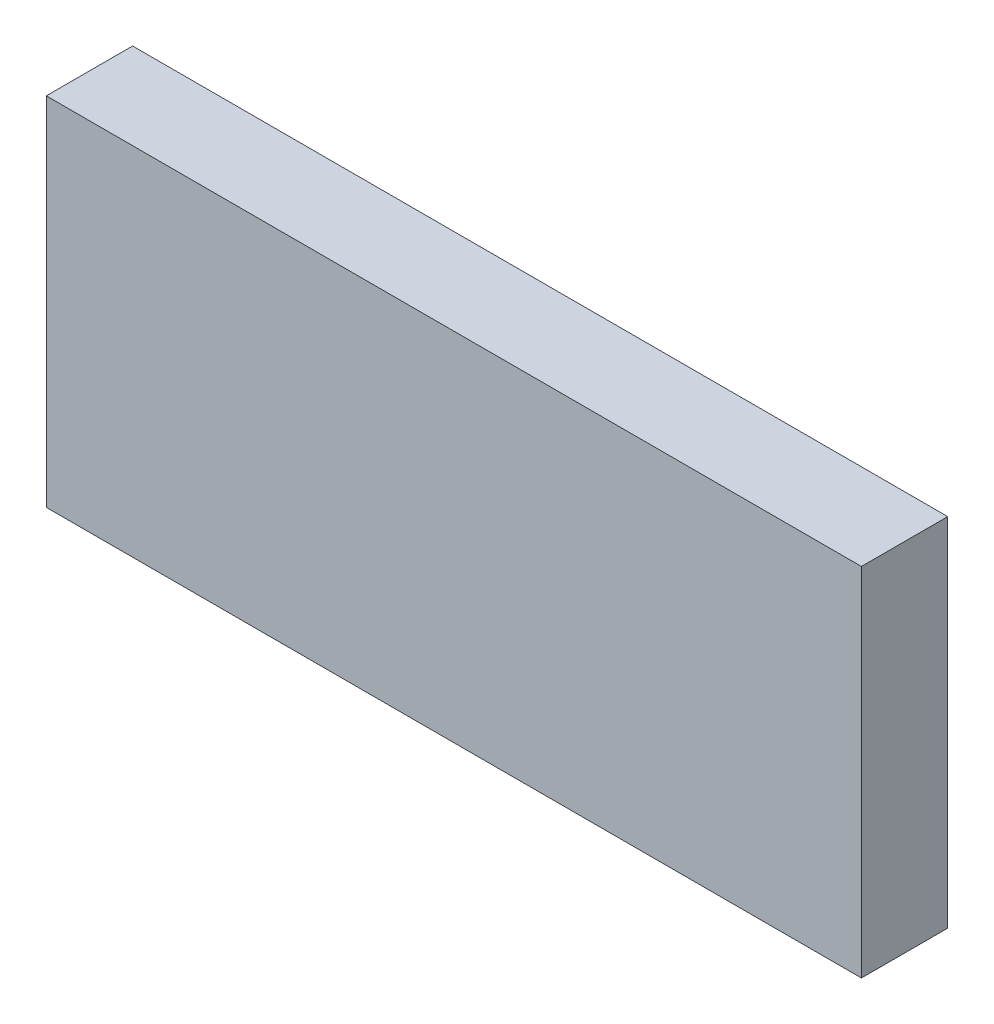
ISO-10303-21;
HEADER;
FILE_DESCRIPTION(('STEP AP214'),'2;1');
FILE_NAME('part.step','',(''),(''),'','','');
FILE_SCHEMA(('AUTOMOTIVE_DESIGN { 1 0 10303 214 1 1 1 1 }'));
ENDSEC;
DATA;
#1=APPLICATION_CONTEXT('core data for automotive mechanical design processes');
#2=APPLICATION_PROTOCOL_DEFINITION('international standard','automotive_design',2000,#1);
#3=PRODUCT_CONTEXT('',#1,'mechanical');
#4=PRODUCT('Part','Part','',(#3));
#5=PRODUCT_RELATED_PRODUCT_CATEGORY('part','',(#4));
#6=PRODUCT_DEFINITION_FORMATION('','',#4);
#7=PRODUCT_DEFINITION_CONTEXT('part definition',#1,'design');
#8=PRODUCT_DEFINITION('design','',#6,#7);
#9=PRODUCT_DEFINITION_SHAPE('','',#8);
#10=(LENGTH_UNIT() NAMED_UNIT(*) SI_UNIT(.MILLI.,.METRE.));
#11=(NAMED_UNIT(*) PLANE_ANGLE_UNIT() SI_UNIT($,.RADIAN.));
#12=(NAMED_UNIT(*) SI_UNIT($,.STERADIAN.) SOLID_ANGLE_UNIT());
#13=UNCERTAINTY_MEASURE_WITH_UNIT(LENGTH_MEASURE(1.E-05),#10,'distance_accuracy_value','');
#14=(GEOMETRIC_REPRESENTATION_CONTEXT(3) GLOBAL_UNCERTAINTY_ASSIGNED_CONTEXT((#13)) GLOBAL_UNIT_ASSIGNED_CONTEXT((#10,
#11,#12)) REPRESENTATION_CONTEXT('',''));
#15=CARTESIAN_POINT('',(0.,0.,0.));
#16=DIRECTION('',(0.,0.,1.));
#17=DIRECTION('',(1.,0.,0.));
#18=AXIS2_PLACEMENT_3D('',#15,#16,#17);
#19=CARTESIAN_POINT('',(-1.19949214,0.52449222,0.));
#20=DIRECTION('',(1.,0.,0.));
#21=DIRECTION('',(0.,-1.,0.));
#22=AXIS2_PLACEMENT_3D('',#19,#20,#21);
#23=PLANE('',#22);
#24=DIRECTION('',(0.,-1.,0.));
#25=VECTOR('',#24,1.);
#26=CARTESIAN_POINT('',(-1.19949214,0.52449222,0.));
#27=LINE('',#26,#25);
#28=CARTESIAN_POINT('',(-1.19949214,0.52449222,0.));
#29=VERTEX_POINT('',#28);
#30=CARTESIAN_POINT('',(-1.19949214,-0.52449222,0.));
#31=VERTEX_POINT('',#30);
#32=EDGE_CURVE('E11',#29,#31,#27,.T.);
#33=ORIENTED_EDGE('',*,*,#32,.T.);
#34=DIRECTION('',(0.,0.,1.));
#35=VECTOR('',#34,1.);
#36=CARTESIAN_POINT('',(-1.19949214,-0.52449222,0.));
#37=LINE('',#36,#35);
#38=CARTESIAN_POINT('',(-1.19949214,-0.52449222,0.254));
#39=VERTEX_POINT('',#38);
#40=EDGE_CURVE('E24',#31,#39,#37,.T.);
#41=ORIENTED_EDGE('',*,*,#40,.T.);
#42=DIRECTION('',(0.,-1.,0.));
#43=VECTOR('',#42,1.);
#44=CARTESIAN_POINT('',(-1.19949214,0.52449222,0.254));
#45=LINE('',#44,#43);
#46=CARTESIAN_POINT('',(-1.19949214,0.52449222,0.254));
#47=VERTEX_POINT('',#46);
#48=EDGE_CURVE('E87',#47,#39,#45,.T.);
#49=ORIENTED_EDGE('',*,*,#48,.F.);
#50=DIRECTION('',(0.,0.,1.));
#51=VECTOR('',#50,1.);
#52=CARTESIAN_POINT('',(-1.19949214,0.52449222,0.));
#53=LINE('',#52,#51);
#54=EDGE_CURVE('E36',#29,#47,#53,.T.);
#55=ORIENTED_EDGE('',*,*,#54,.F.);
#56=EDGE_LOOP('',(#33,#41,#49,#55));
#57=FACE_BOUND('',#56,.T.);
#58=ADVANCED_FACE('F17',(#57),#23,.F.);
#59=CARTESIAN_POINT('',(-1.19949214,-0.52449222,0.));
#60=DIRECTION('',(0.,1.,0.));
#61=DIRECTION('',(1.,0.,0.));
#62=AXIS2_PLACEMENT_3D('',#59,#60,#61);
#63=PLANE('',#62);
#64=DIRECTION('',(1.,0.,0.));
#65=VECTOR('',#64,1.);
#66=CARTESIAN_POINT('',(-1.19949214,-0.52449222,0.));
#67=LINE('',#66,#65);
#68=CARTESIAN_POINT('',(1.19949214,-0.52449222,0.));
#69=VERTEX_POINT('',#68);
#70=EDGE_CURVE('E84',#31,#69,#67,.T.);
#71=ORIENTED_EDGE('',*,*,#70,.T.);
#72=DIRECTION('',(0.,0.,1.));
#73=VECTOR('',#72,1.);
#74=CARTESIAN_POINT('',(1.19949214,-0.52449222,0.));
#75=LINE('',#74,#73);
#76=CARTESIAN_POINT('',(1.19949214,-0.52449222,0.254));
#77=VERTEX_POINT('',#76);
#78=EDGE_CURVE('E82',#69,#77,#75,.T.);
#79=ORIENTED_EDGE('',*,*,#78,.T.);
#80=DIRECTION('',(1.,0.,0.));
#81=VECTOR('',#80,1.);
#82=CARTESIAN_POINT('',(-1.19949214,-0.52449222,0.254));
#83=LINE('',#82,#81);
#84=EDGE_CURVE('E62',#39,#77,#83,.T.);
#85=ORIENTED_EDGE('',*,*,#84,.F.);
#86=ORIENTED_EDGE('',*,*,#40,.F.);
#87=EDGE_LOOP('',(#71,#79,#85,#86));
#88=FACE_BOUND('',#87,.T.);
#89=ADVANCED_FACE('F89',(#88),#63,.F.);
#90=CARTESIAN_POINT('',(1.19949214,-0.52449222,0.));
#91=DIRECTION('',(-1.,0.,0.));
#92=DIRECTION('',(0.,1.,0.));
#93=AXIS2_PLACEMENT_3D('',#90,#91,#92);
#94=PLANE('',#93);
#95=DIRECTION('',(0.,1.,0.));
#96=VECTOR('',#95,1.);
#97=CARTESIAN_POINT('',(1.19949214,-0.52449222,0.));
#98=LINE('',#97,#96);
#99=CARTESIAN_POINT('',(1.19949214,0.52449222,0.));
#100=VERTEX_POINT('',#99);
#101=EDGE_CURVE('E71',#69,#100,#98,.T.);
#102=ORIENTED_EDGE('',*,*,#101,.T.);
#103=DIRECTION('',(0.,0.,1.));
#104=VECTOR('',#103,1.);
#105=CARTESIAN_POINT('',(1.19949214,0.52449222,0.));
#106=LINE('',#105,#104);
#107=CARTESIAN_POINT('',(1.19949214,0.52449222,0.254));
#108=VERTEX_POINT('',#107);
#109=EDGE_CURVE('E65',#100,#108,#106,.T.);
#110=ORIENTED_EDGE('',*,*,#109,.T.);
#111=DIRECTION('',(0.,1.,0.));
#112=VECTOR('',#111,1.);
#113=CARTESIAN_POINT('',(1.19949214,-0.52449222,0.254));
#114=LINE('',#113,#112);
#115=EDGE_CURVE('E57',#77,#108,#114,.T.);
#116=ORIENTED_EDGE('',*,*,#115,.F.);
#117=ORIENTED_EDGE('',*,*,#78,.F.);
#118=EDGE_LOOP('',(#102,#110,#116,#117));
#119=FACE_BOUND('',#118,.T.);
#120=ADVANCED_FACE('F69',(#119),#94,.F.);
#121=CARTESIAN_POINT('',(1.19949214,0.52449222,0.));
#122=DIRECTION('',(0.,-1.,0.));
#123=DIRECTION('',(-1.,0.,0.));
#124=AXIS2_PLACEMENT_3D('',#121,#122,#123);
#125=PLANE('',#124);
#126=DIRECTION('',(-1.,0.,0.));
#127=VECTOR('',#126,1.);
#128=CARTESIAN_POINT('',(1.19949214,0.52449222,0.));
#129=LINE('',#128,#127);
#130=EDGE_CURVE('E66',#100,#29,#129,.T.);
#131=ORIENTED_EDGE('',*,*,#130,.T.);
#132=ORIENTED_EDGE('',*,*,#54,.T.);
#133=DIRECTION('',(-1.,0.,0.));
#134=VECTOR('',#133,1.);
#135=CARTESIAN_POINT('',(1.19949214,0.52449222,0.254));
#136=LINE('',#135,#134);
#137=EDGE_CURVE('E61',#108,#47,#136,.T.);
#138=ORIENTED_EDGE('',*,*,#137,.F.);
#139=ORIENTED_EDGE('',*,*,#109,.F.);
#140=EDGE_LOOP('',(#131,#132,#138,#139));
#141=FACE_BOUND('',#140,.T.);
#142=ADVANCED_FACE('F76',(#141),#125,.F.);
#143=CARTESIAN_POINT('',(-1.19949214,0.52449222,0.));
#144=DIRECTION('',(0.,0.,-1.));
#145=DIRECTION('',(-1.,0.,0.));
#146=AXIS2_PLACEMENT_3D('',#143,#144,#145);
#147=PLANE('',#146);
#148=ORIENTED_EDGE('',*,*,#130,.F.);
#149=ORIENTED_EDGE('',*,*,#101,.F.);
#150=ORIENTED_EDGE('',*,*,#70,.F.);
#151=ORIENTED_EDGE('',*,*,#32,.F.);
#152=EDGE_LOOP('',(#148,#149,#150,#151));
#153=FACE_BOUND('',#152,.T.);
#154=ADVANCED_FACE('F91',(#153),#147,.T.);
#155=CARTESIAN_POINT('',(-1.19949214,0.52449222,0.254));
#156=DIRECTION('',(0.,0.,-1.));
#157=DIRECTION('',(-1.,0.,0.));
#158=AXIS2_PLACEMENT_3D('',#155,#156,#157);
#159=PLANE('',#158);
#160=ORIENTED_EDGE('',*,*,#48,.T.);
#161=ORIENTED_EDGE('',*,*,#84,.T.);
#162=ORIENTED_EDGE('',*,*,#115,.T.);
#163=ORIENTED_EDGE('',*,*,#137,.T.);
#164=EDGE_LOOP('',(#160,#161,#162,#163));
#165=FACE_BOUND('',#164,.T.);
#166=ADVANCED_FACE('F59',(#165),#159,.F.);
#167=CLOSED_SHELL('',(#58,#89,#120,#142,#154,#166));
#168=MANIFOLD_SOLID_BREP('B1',#167);
#169=ADVANCED_BREP_SHAPE_REPRESENTATION('',(#18,#168),#14);
#170=SHAPE_DEFINITION_REPRESENTATION(#9,#169);
ENDSEC;
END-ISO-10303-21;
